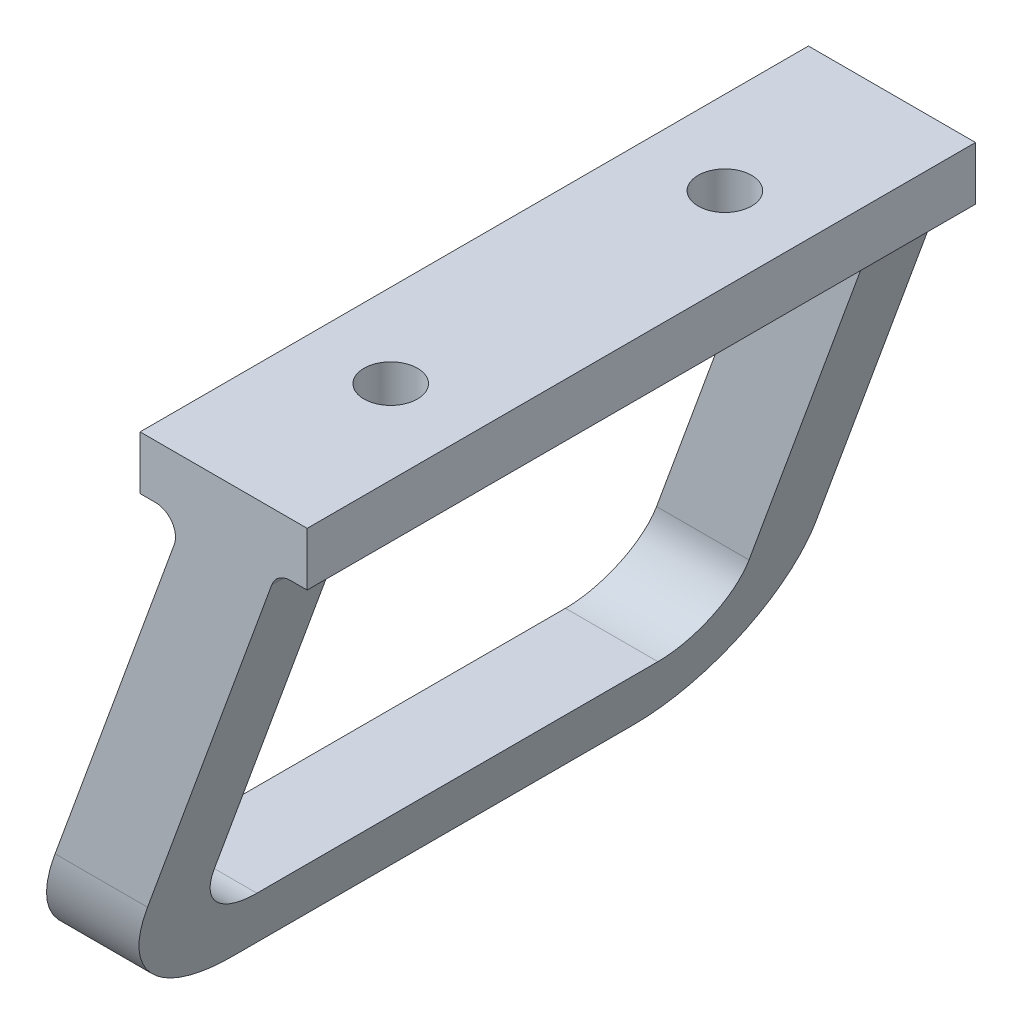
ISO-10303-21;
HEADER;
FILE_DESCRIPTION(('STEP AP214'),'2;1');
FILE_NAME('part.step','',(''),(''),'','','');
FILE_SCHEMA(('AUTOMOTIVE_DESIGN { 1 0 10303 214 1 1 1 1 }'));
ENDSEC;
DATA;
#1=APPLICATION_CONTEXT('core data for automotive mechanical design processes');
#2=APPLICATION_PROTOCOL_DEFINITION('international standard','automotive_design',2000,#1);
#3=PRODUCT_CONTEXT('',#1,'mechanical');
#4=PRODUCT('Part','Part','',(#3));
#5=PRODUCT_RELATED_PRODUCT_CATEGORY('part','',(#4));
#6=PRODUCT_DEFINITION_FORMATION('','',#4);
#7=PRODUCT_DEFINITION_CONTEXT('part definition',#1,'design');
#8=PRODUCT_DEFINITION('design','',#6,#7);
#9=PRODUCT_DEFINITION_SHAPE('','',#8);
#10=(LENGTH_UNIT() NAMED_UNIT(*) SI_UNIT(.MILLI.,.METRE.));
#11=(NAMED_UNIT(*) PLANE_ANGLE_UNIT() SI_UNIT($,.RADIAN.));
#12=(NAMED_UNIT(*) SI_UNIT($,.STERADIAN.) SOLID_ANGLE_UNIT());
#13=UNCERTAINTY_MEASURE_WITH_UNIT(LENGTH_MEASURE(1.E-05),#10,'distance_accuracy_value','');
#14=(GEOMETRIC_REPRESENTATION_CONTEXT(3) GLOBAL_UNCERTAINTY_ASSIGNED_CONTEXT((#13)) GLOBAL_UNIT_ASSIGNED_CONTEXT((#10,
#11,#12)) REPRESENTATION_CONTEXT('',''));
#15=CARTESIAN_POINT('',(0.,0.,0.));
#16=DIRECTION('',(0.,0.,1.));
#17=DIRECTION('',(1.,0.,0.));
#18=AXIS2_PLACEMENT_3D('',#15,#16,#17);
#19=CARTESIAN_POINT('',(-3.93799216364615,1.43331193034076,100.));
#20=DIRECTION('',(-0.939692620785908,0.342020143325669,0.));
#21=DIRECTION('',(-0.342020143325669,-0.939692620785908,0.));
#22=AXIS2_PLACEMENT_3D('',#19,#20,#21);
#23=PLANE('',#22);
#24=DIRECTION('',(0.,0.,1.));
#25=VECTOR('',#24,1.);
#26=CARTESIAN_POINT('',(-28.860297657338,-67.0401596543272,100.));
#27=LINE('',#26,#25);
#28=CARTESIAN_POINT('',(-28.860297657338,-67.0401596543272,20.0000000000001));
#29=VERTEX_POINT('',#28);
#30=CARTESIAN_POINT('',(-28.860297657338,-67.0401596543272,79.9999999999999));
#31=VERTEX_POINT('',#30);
#32=EDGE_CURVE('E289',#29,#31,#27,.T.);
#33=ORIENTED_EDGE('',*,*,#32,.F.);
#34=CARTESIAN_POINT('',(-25.2205953146759,-57.0401596543272,20.));
#35=DIRECTION('',(-0.939692620785908,0.342020143325669,0.));
#36=DIRECTION('',(-0.342020143325669,-0.939692620785908,0.));
#37=AXIS2_PLACEMENT_3D('',#34,#35,#36);
#38=ELLIPSE('',#37,10.6417777247591,10.);
#39=CARTESIAN_POINT('',(-25.2205953146759,-57.0401596543272,9.99999999999999));
#40=VERTEX_POINT('',#39);
#41=EDGE_CURVE('E402',#29,#40,#38,.F.);
#42=ORIENTED_EDGE('',*,*,#41,.T.);
#43=DIRECTION('',(0.342020143325669,0.939692620785908,0.));
#44=VECTOR('',#43,1.);
#45=CARTESIAN_POINT('',(-3.93799216364615,1.43331193034076,9.99999999999999));
#46=LINE('',#45,#44);
#47=CARTESIAN_POINT('',(-8.46334761963706,-11.,9.99999999999999));
#48=VERTEX_POINT('',#47);
#49=EDGE_CURVE('E398',#40,#48,#46,.T.);
#50=ORIENTED_EDGE('',*,*,#49,.T.);
#51=DIRECTION('',(0.,0.,1.));
#52=VECTOR('',#51,1.);
#53=CARTESIAN_POINT('',(-8.46334761963705,-11.,100.));
#54=LINE('',#53,#52);
#55=CARTESIAN_POINT('',(-8.46334761963705,-11.,90.));
#56=VERTEX_POINT('',#55);
#57=EDGE_CURVE('E394',#48,#56,#54,.T.);
#58=ORIENTED_EDGE('',*,*,#57,.T.);
#59=DIRECTION('',(0.342020143325669,0.939692620785908,0.));
#60=VECTOR('',#59,1.);
#61=CARTESIAN_POINT('',(-3.93799216364615,1.43331193034076,90.));
#62=LINE('',#61,#60);
#63=CARTESIAN_POINT('',(-25.2205953146759,-57.0401596543272,90.));
#64=VERTEX_POINT('',#63);
#65=EDGE_CURVE('E391',#64,#56,#62,.T.);
#66=ORIENTED_EDGE('',*,*,#65,.F.);
#67=CARTESIAN_POINT('',(-25.2205953146759,-57.0401596543272,80.));
#68=DIRECTION('',(-0.939692620785908,0.342020143325669,0.));
#69=DIRECTION('',(-0.342020143325669,-0.939692620785908,0.));
#70=AXIS2_PLACEMENT_3D('',#67,#68,#69);
#71=ELLIPSE('',#70,10.6417777247591,9.99999999999999);
#72=EDGE_CURVE('E388',#31,#64,#71,.T.);
#73=ORIENTED_EDGE('',*,*,#72,.F.);
#74=EDGE_LOOP('',(#33,#42,#50,#58,#66,#73));
#75=FACE_BOUND('',#74,.T.);
#76=DIRECTION('',(0.342020143325669,0.939692620785908,0.));
#77=VECTOR('',#76,1.);
#78=CARTESIAN_POINT('',(-3.93799216364615,1.43331193034076,0.));
#79=LINE('',#78,#77);
#80=CARTESIAN_POINT('',(-25.2205953146759,-57.0401596543272,0.));
#81=VERTEX_POINT('',#80);
#82=CARTESIAN_POINT('',(-7.38092213764225,-8.02606042997701,0.));
#83=VERTEX_POINT('',#82);
#84=EDGE_CURVE('E444',#81,#83,#79,.T.);
#85=ORIENTED_EDGE('',*,*,#84,.F.);
#86=CARTESIAN_POINT('',(-25.2205953146759,-57.0401596543272,20.));
#87=DIRECTION('',(-0.939692620785908,0.342020143325669,0.));
#88=DIRECTION('',(-0.342020143325669,-0.939692620785908,0.));
#89=AXIS2_PLACEMENT_3D('',#86,#87,#88);
#90=ELLIPSE('',#89,21.2835554495182,20.);
#91=CARTESIAN_POINT('',(-32.5,-77.0401596543272,20.));
#92=VERTEX_POINT('',#91);
#93=EDGE_CURVE('E305',#81,#92,#90,.T.);
#94=ORIENTED_EDGE('',*,*,#93,.T.);
#95=DIRECTION('',(0.,0.,-1.));
#96=VECTOR('',#95,1.);
#97=CARTESIAN_POINT('',(-32.5,-77.0401596543272,100.));
#98=LINE('',#97,#96);
#99=CARTESIAN_POINT('',(-32.5,-77.0401596543272,80.));
#100=VERTEX_POINT('',#99);
#101=EDGE_CURVE('E297',#100,#92,#98,.T.);
#102=ORIENTED_EDGE('',*,*,#101,.F.);
#103=CARTESIAN_POINT('',(-25.2205953146759,-57.0401596543272,80.));
#104=DIRECTION('',(-0.939692620785908,0.342020143325669,0.));
#105=DIRECTION('',(-0.342020143325669,-0.939692620785908,0.));
#106=AXIS2_PLACEMENT_3D('',#103,#104,#105);
#107=ELLIPSE('',#106,21.2835554495182,20.);
#108=CARTESIAN_POINT('',(-25.2205953146759,-57.0401596543272,100.));
#109=VERTEX_POINT('',#108);
#110=EDGE_CURVE('E278',#100,#109,#107,.T.);
#111=ORIENTED_EDGE('',*,*,#110,.T.);
#112=DIRECTION('',(0.342020143325669,0.939692620785908,0.));
#113=VECTOR('',#112,1.);
#114=CARTESIAN_POINT('',(-3.93799216364615,1.43331193034076,100.));
#115=LINE('',#114,#113);
#116=CARTESIAN_POINT('',(-7.38092213764225,-8.02606042997701,100.));
#117=VERTEX_POINT('',#116);
#118=EDGE_CURVE('E411',#109,#117,#115,.T.);
#119=ORIENTED_EDGE('',*,*,#118,.T.);
#120=DIRECTION('',(0.,0.,-1.));
#121=VECTOR('',#120,1.);
#122=CARTESIAN_POINT('',(-7.38092213764225,-8.02606042997701,100.));
#123=LINE('',#122,#121);
#124=EDGE_CURVE('E307',#117,#83,#123,.T.);
#125=ORIENTED_EDGE('',*,*,#124,.T.);
#126=EDGE_LOOP('',(#85,#94,#102,#111,#119,#125));
#127=FACE_BOUND('',#126,.T.);
#128=ADVANCED_FACE('F152',(#75,#127),#23,.T.);
#129=CARTESIAN_POINT('',(0.,-77.0401596543272,100.));
#130=DIRECTION('',(0.,-1.,0.));
#131=DIRECTION('',(0.,0.,-1.));
#132=AXIS2_PLACEMENT_3D('',#129,#130,#131);
#133=PLANE('',#132);
#134=DIRECTION('',(-1.,0.,0.));
#135=VECTOR('',#134,1.);
#136=CARTESIAN_POINT('',(12.5,-77.0401596543272,20.));
#137=LINE('',#136,#135);
#138=CARTESIAN_POINT('',(-18.6656889578131,-77.0401596543272,20.));
#139=VERTEX_POINT('',#138);
#140=EDGE_CURVE('E301',#139,#92,#137,.T.);
#141=ORIENTED_EDGE('',*,*,#140,.F.);
#142=DIRECTION('',(0.,0.,-1.));
#143=VECTOR('',#142,1.);
#144=CARTESIAN_POINT('',(-18.6656889578131,-77.0401596543272,100.));
#145=LINE('',#144,#143);
#146=CARTESIAN_POINT('',(-18.6656889578131,-77.0401596543272,80.));
#147=VERTEX_POINT('',#146);
#148=EDGE_CURVE('E299',#147,#139,#145,.T.);
#149=ORIENTED_EDGE('',*,*,#148,.F.);
#150=DIRECTION('',(-1.,0.,0.));
#151=VECTOR('',#150,1.);
#152=CARTESIAN_POINT('',(12.5,-77.0401596543272,80.));
#153=LINE('',#152,#151);
#154=EDGE_CURVE('E281',#147,#100,#153,.T.);
#155=ORIENTED_EDGE('',*,*,#154,.T.);
#156=ORIENTED_EDGE('',*,*,#101,.T.);
#157=EDGE_LOOP('',(#141,#149,#155,#156));
#158=FACE_BOUND('',#157,.T.);
#159=ADVANCED_FACE('F296',(#158),#133,.T.);
#160=CARTESIAN_POINT('',(8.27801190657065,-3.01294993289294,100.));
#161=DIRECTION('',(0.939692620785908,-0.342020143325669,0.));
#162=DIRECTION('',(0.342020143325669,0.939692620785908,0.));
#163=AXIS2_PLACEMENT_3D('',#160,#161,#162);
#164=PLANE('',#163);
#165=DIRECTION('',(-0.342020143325669,-0.939692620785908,0.));
#166=VECTOR('',#165,1.);
#167=CARTESIAN_POINT('',(8.27801190657065,-3.01294993289294,9.99999999999999));
#168=LINE('',#167,#166);
#169=CARTESIAN_POINT('',(5.3709634225498,-11.,9.99999999999999));
#170=VERTEX_POINT('',#169);
#171=CARTESIAN_POINT('',(-11.3862842724891,-57.0401596543272,9.99999999999999));
#172=VERTEX_POINT('',#171);
#173=EDGE_CURVE('E162',#170,#172,#168,.T.);
#174=ORIENTED_EDGE('',*,*,#173,.T.);
#175=CARTESIAN_POINT('',(-11.3862842724891,-57.0401596543272,20.));
#176=DIRECTION('',(0.939692620785908,-0.342020143325669,0.));
#177=DIRECTION('',(-0.342020143325669,-0.939692620785908,0.));
#178=AXIS2_PLACEMENT_3D('',#175,#176,#177);
#179=ELLIPSE('',#178,10.6417777247591,10.);
#180=CARTESIAN_POINT('',(-15.0259866151511,-67.0401596543272,20.0000000000001));
#181=VERTEX_POINT('',#180);
#182=EDGE_CURVE('E12',#172,#181,#179,.F.);
#183=ORIENTED_EDGE('',*,*,#182,.T.);
#184=DIRECTION('',(0.,0.,-1.));
#185=VECTOR('',#184,1.);
#186=CARTESIAN_POINT('',(-15.0259866151511,-67.0401596543272,100.));
#187=LINE('',#186,#185);
#188=CARTESIAN_POINT('',(-15.0259866151511,-67.0401596543272,79.9999999999999));
#189=VERTEX_POINT('',#188);
#190=EDGE_CURVE('E323',#189,#181,#187,.T.);
#191=ORIENTED_EDGE('',*,*,#190,.F.);
#192=CARTESIAN_POINT('',(-11.3862842724891,-57.0401596543272,80.));
#193=DIRECTION('',(0.939692620785908,-0.342020143325669,0.));
#194=DIRECTION('',(-0.342020143325669,-0.939692620785908,0.));
#195=AXIS2_PLACEMENT_3D('',#192,#193,#194);
#196=ELLIPSE('',#195,10.6417777247591,9.99999999999999);
#197=CARTESIAN_POINT('',(-11.386284272489,-57.0401596543272,90.));
#198=VERTEX_POINT('',#197);
#199=EDGE_CURVE('E326',#198,#189,#196,.T.);
#200=ORIENTED_EDGE('',*,*,#199,.F.);
#201=DIRECTION('',(-0.342020143325669,-0.939692620785908,0.));
#202=VECTOR('',#201,1.);
#203=CARTESIAN_POINT('',(8.27801190657065,-3.01294993289294,90.));
#204=LINE('',#203,#202);
#205=CARTESIAN_POINT('',(5.3709634225498,-11.,90.));
#206=VERTEX_POINT('',#205);
#207=EDGE_CURVE('E329',#206,#198,#204,.T.);
#208=ORIENTED_EDGE('',*,*,#207,.F.);
#209=DIRECTION('',(0.,0.,-1.));
#210=VECTOR('',#209,1.);
#211=CARTESIAN_POINT('',(5.3709634225498,-11.,100.));
#212=LINE('',#211,#210);
#213=EDGE_CURVE('E332',#206,#170,#212,.T.);
#214=ORIENTED_EDGE('',*,*,#213,.T.);
#215=EDGE_LOOP('',(#174,#183,#191,#200,#208,#214));
#216=FACE_BOUND('',#215,.T.);
#217=ORIENTED_EDGE('',*,*,#148,.T.);
#218=CARTESIAN_POINT('',(-11.3862842724891,-57.0401596543272,20.));
#219=DIRECTION('',(0.939692620785908,-0.342020143325669,0.));
#220=DIRECTION('',(-0.342020143325669,-0.939692620785908,0.));
#221=AXIS2_PLACEMENT_3D('',#218,#219,#220);
#222=ELLIPSE('',#221,21.2835554495182,20.);
#223=CARTESIAN_POINT('',(-11.3862842724891,-57.0401596543271,0.));
#224=VERTEX_POINT('',#223);
#225=EDGE_CURVE('E362',#139,#224,#222,.T.);
#226=ORIENTED_EDGE('',*,*,#225,.T.);
#227=DIRECTION('',(-0.342020143325669,-0.939692620785908,0.));
#228=VECTOR('',#227,1.);
#229=CARTESIAN_POINT('',(8.27801190657065,-3.01294993289294,0.));
#230=LINE('',#229,#228);
#231=CARTESIAN_POINT('',(7.20029981468462,-5.97393957002299,0.));
#232=VERTEX_POINT('',#231);
#233=EDGE_CURVE('E447',#232,#224,#230,.T.);
#234=ORIENTED_EDGE('',*,*,#233,.F.);
#235=DIRECTION('',(0.,0.,-1.));
#236=VECTOR('',#235,1.);
#237=CARTESIAN_POINT('',(7.20029981468462,-5.97393957002299,100.));
#238=LINE('',#237,#236);
#239=CARTESIAN_POINT('',(7.20029981468462,-5.97393957002299,100.));
#240=VERTEX_POINT('',#239);
#241=EDGE_CURVE('E314',#240,#232,#238,.T.);
#242=ORIENTED_EDGE('',*,*,#241,.F.);
#243=DIRECTION('',(-0.342020143325669,-0.939692620785908,0.));
#244=VECTOR('',#243,1.);
#245=CARTESIAN_POINT('',(8.27801190657065,-3.01294993289294,100.));
#246=LINE('',#245,#244);
#247=CARTESIAN_POINT('',(-11.3862842724891,-57.0401596543272,100.));
#248=VERTEX_POINT('',#247);
#249=EDGE_CURVE('E415',#240,#248,#246,.T.);
#250=ORIENTED_EDGE('',*,*,#249,.T.);
#251=CARTESIAN_POINT('',(-11.3862842724891,-57.0401596543272,80.));
#252=DIRECTION('',(0.939692620785908,-0.342020143325669,0.));
#253=DIRECTION('',(-0.342020143325669,-0.939692620785908,0.));
#254=AXIS2_PLACEMENT_3D('',#251,#252,#253);
#255=ELLIPSE('',#254,21.2835554495182,20.);
#256=EDGE_CURVE('E290',#248,#147,#255,.T.);
#257=ORIENTED_EDGE('',*,*,#256,.T.);
#258=EDGE_LOOP('',(#217,#226,#234,#242,#250,#257));
#259=FACE_BOUND('',#258,.T.);
#260=ADVANCED_FACE('F498',(#216,#259),#164,.T.);
#261=CARTESIAN_POINT('',(-10.2,-7.,100.));
#262=DIRECTION('',(0.,0.,-1.));
#263=DIRECTION('',(-1.,0.,0.));
#264=AXIS2_PLACEMENT_3D('',#261,#262,#263);
#265=CYLINDRICAL_SURFACE('',#264,3.00000000000001);
#266=CARTESIAN_POINT('',(-10.2,-7.,0.));
#267=DIRECTION('',(0.,0.,1.));
#268=DIRECTION('',(1.,0.,0.));
#269=AXIS2_PLACEMENT_3D('',#266,#267,#268);
#270=CIRCLE('',#269,3.00000000000001);
#271=CARTESIAN_POINT('',(-10.2,-4.,0.));
#272=VERTEX_POINT('',#271);
#273=EDGE_CURVE('E406',#83,#272,#270,.T.);
#274=ORIENTED_EDGE('',*,*,#273,.F.);
#275=ORIENTED_EDGE('',*,*,#124,.F.);
#276=CARTESIAN_POINT('',(-10.2,-7.,100.));
#277=DIRECTION('',(0.,0.,1.));
#278=DIRECTION('',(1.,0.,0.));
#279=AXIS2_PLACEMENT_3D('',#276,#277,#278);
#280=CIRCLE('',#279,3.00000000000001);
#281=CARTESIAN_POINT('',(-10.2,-4.,100.));
#282=VERTEX_POINT('',#281);
#283=EDGE_CURVE('E407',#117,#282,#280,.T.);
#284=ORIENTED_EDGE('',*,*,#283,.T.);
#285=DIRECTION('',(0.,0.,-1.));
#286=VECTOR('',#285,1.);
#287=CARTESIAN_POINT('',(-10.2,-4.,100.));
#288=LINE('',#287,#286);
#289=EDGE_CURVE('E440',#282,#272,#288,.T.);
#290=ORIENTED_EDGE('',*,*,#289,.T.);
#291=EDGE_LOOP('',(#274,#275,#284,#290));
#292=FACE_BOUND('',#291,.T.);
#293=ADVANCED_FACE('F154',(#292),#265,.F.);
#294=CARTESIAN_POINT('',(10.0193776770423,-7.,100.));
#295=DIRECTION('',(0.,0.,-1.));
#296=DIRECTION('',(-1.,0.,0.));
#297=AXIS2_PLACEMENT_3D('',#294,#295,#296);
#298=CYLINDRICAL_SURFACE('',#297,3.);
#299=CARTESIAN_POINT('',(10.0193776770423,-7.,0.));
#300=DIRECTION('',(0.,0.,1.));
#301=DIRECTION('',(1.,0.,0.));
#302=AXIS2_PLACEMENT_3D('',#299,#300,#301);
#303=CIRCLE('',#302,3.);
#304=CARTESIAN_POINT('',(10.0193776770423,-4.,0.));
#305=VERTEX_POINT('',#304);
#306=EDGE_CURVE('E451',#305,#232,#303,.T.);
#307=ORIENTED_EDGE('',*,*,#306,.F.);
#308=DIRECTION('',(0.,0.,-1.));
#309=VECTOR('',#308,1.);
#310=CARTESIAN_POINT('',(10.0193776770423,-4.,100.));
#311=LINE('',#310,#309);
#312=CARTESIAN_POINT('',(10.0193776770423,-4.,100.));
#313=VERTEX_POINT('',#312);
#314=EDGE_CURVE('E488',#313,#305,#311,.T.);
#315=ORIENTED_EDGE('',*,*,#314,.F.);
#316=CARTESIAN_POINT('',(10.0193776770423,-7.,100.));
#317=DIRECTION('',(0.,0.,1.));
#318=DIRECTION('',(1.,0.,0.));
#319=AXIS2_PLACEMENT_3D('',#316,#317,#318);
#320=CIRCLE('',#319,3.);
#321=EDGE_CURVE('E419',#313,#240,#320,.T.);
#322=ORIENTED_EDGE('',*,*,#321,.T.);
#323=ORIENTED_EDGE('',*,*,#241,.T.);
#324=EDGE_LOOP('',(#307,#315,#322,#323));
#325=FACE_BOUND('',#324,.T.);
#326=ADVANCED_FACE('F494',(#325),#298,.F.);
#327=CARTESIAN_POINT('',(0.,-4.,100.));
#328=DIRECTION('',(0.,1.,0.));
#329=DIRECTION('',(-1.,0.,0.));
#330=AXIS2_PLACEMENT_3D('',#327,#328,#329);
#331=PLANE('',#330);
#332=DIRECTION('',(1.,0.,0.));
#333=VECTOR('',#332,1.);
#334=CARTESIAN_POINT('',(0.,-4.,0.));
#335=LINE('',#334,#333);
#336=CARTESIAN_POINT('',(12.5,-4.,0.));
#337=VERTEX_POINT('',#336);
#338=EDGE_CURVE('E455',#305,#337,#335,.T.);
#339=ORIENTED_EDGE('',*,*,#338,.T.);
#340=DIRECTION('',(0.,0.,-1.));
#341=VECTOR('',#340,1.);
#342=CARTESIAN_POINT('',(12.5,-4.,100.));
#343=LINE('',#342,#341);
#344=CARTESIAN_POINT('',(12.5,-4.,100.));
#345=VERTEX_POINT('',#344);
#346=EDGE_CURVE('E485',#345,#337,#343,.T.);
#347=ORIENTED_EDGE('',*,*,#346,.F.);
#348=DIRECTION('',(1.,0.,0.));
#349=VECTOR('',#348,1.);
#350=CARTESIAN_POINT('',(0.,-4.,100.));
#351=LINE('',#350,#349);
#352=EDGE_CURVE('E423',#313,#345,#351,.T.);
#353=ORIENTED_EDGE('',*,*,#352,.F.);
#354=ORIENTED_EDGE('',*,*,#314,.T.);
#355=EDGE_LOOP('',(#339,#347,#353,#354));
#356=FACE_BOUND('',#355,.T.);
#357=ADVANCED_FACE('F505',(#356),#331,.F.);
#358=CARTESIAN_POINT('',(12.5,0.,100.));
#359=DIRECTION('',(1.,0.,0.));
#360=DIRECTION('',(0.,1.,0.));
#361=AXIS2_PLACEMENT_3D('',#358,#359,#360);
#362=PLANE('',#361);
#363=DIRECTION('',(0.,-1.,0.));
#364=VECTOR('',#363,1.);
#365=CARTESIAN_POINT('',(12.5,0.,0.));
#366=LINE('',#365,#364);
#367=CARTESIAN_POINT('',(12.5,4.,0.));
#368=VERTEX_POINT('',#367);
#369=EDGE_CURVE('E459',#368,#337,#366,.T.);
#370=ORIENTED_EDGE('',*,*,#369,.F.);
#371=DIRECTION('',(0.,0.,-1.));
#372=VECTOR('',#371,1.);
#373=CARTESIAN_POINT('',(12.5,4.,100.));
#374=LINE('',#373,#372);
#375=CARTESIAN_POINT('',(12.5,4.,100.));
#376=VERTEX_POINT('',#375);
#377=EDGE_CURVE('E482',#376,#368,#374,.T.);
#378=ORIENTED_EDGE('',*,*,#377,.F.);
#379=DIRECTION('',(0.,-1.,0.));
#380=VECTOR('',#379,1.);
#381=CARTESIAN_POINT('',(12.5,0.,100.));
#382=LINE('',#381,#380);
#383=EDGE_CURVE('E426',#376,#345,#382,.T.);
#384=ORIENTED_EDGE('',*,*,#383,.T.);
#385=ORIENTED_EDGE('',*,*,#346,.T.);
#386=EDGE_LOOP('',(#370,#378,#384,#385));
#387=FACE_BOUND('',#386,.T.);
#388=ADVANCED_FACE('F544',(#387),#362,.T.);
#389=CARTESIAN_POINT('',(0.,4.,100.));
#390=DIRECTION('',(0.,1.,0.));
#391=DIRECTION('',(0.,0.,1.));
#392=AXIS2_PLACEMENT_3D('',#389,#390,#391);
#393=PLANE('',#392);
#394=CARTESIAN_POINT('',(0.,4.,25.));
#395=DIRECTION('',(0.,1.,0.));
#396=DIRECTION('',(0.,0.,1.));
#397=AXIS2_PLACEMENT_3D('',#394,#395,#396);
#398=CIRCLE('',#397,4.);
#399=CARTESIAN_POINT('',(0.,4.,29.));
#400=VERTEX_POINT('',#399);
#401=EDGE_CURVE('E351',#400,#400,#398,.T.);
#402=ORIENTED_EDGE('',*,*,#401,.F.);
#403=EDGE_LOOP('',(#402));
#404=FACE_BOUND('',#403,.T.);
#405=CARTESIAN_POINT('',(0.,4.,75.));
#406=DIRECTION('',(0.,1.,0.));
#407=DIRECTION('',(0.,0.,1.));
#408=AXIS2_PLACEMENT_3D('',#405,#406,#407);
#409=CIRCLE('',#408,4.);
#410=CARTESIAN_POINT('',(0.,4.,79.));
#411=VERTEX_POINT('',#410);
#412=EDGE_CURVE('E341',#411,#411,#409,.T.);
#413=ORIENTED_EDGE('',*,*,#412,.F.);
#414=EDGE_LOOP('',(#413));
#415=FACE_BOUND('',#414,.T.);
#416=DIRECTION('',(1.,0.,0.));
#417=VECTOR('',#416,1.);
#418=CARTESIAN_POINT('',(0.,4.,0.));
#419=LINE('',#418,#417);
#420=CARTESIAN_POINT('',(-12.5,4.,0.));
#421=VERTEX_POINT('',#420);
#422=EDGE_CURVE('E463',#421,#368,#419,.T.);
#423=ORIENTED_EDGE('',*,*,#422,.F.);
#424=DIRECTION('',(0.,0.,-1.));
#425=VECTOR('',#424,1.);
#426=CARTESIAN_POINT('',(-12.5,4.,100.));
#427=LINE('',#426,#425);
#428=CARTESIAN_POINT('',(-12.5,4.,100.));
#429=VERTEX_POINT('',#428);
#430=EDGE_CURVE('E479',#429,#421,#427,.T.);
#431=ORIENTED_EDGE('',*,*,#430,.F.);
#432=DIRECTION('',(1.,0.,0.));
#433=VECTOR('',#432,1.);
#434=CARTESIAN_POINT('',(0.,4.,100.));
#435=LINE('',#434,#433);
#436=EDGE_CURVE('E430',#429,#376,#435,.T.);
#437=ORIENTED_EDGE('',*,*,#436,.T.);
#438=ORIENTED_EDGE('',*,*,#377,.T.);
#439=EDGE_LOOP('',(#423,#431,#437,#438));
#440=FACE_BOUND('',#439,.T.);
#441=ADVANCED_FACE('F547',(#404,#415,#440),#393,.T.);
#442=CARTESIAN_POINT('',(-12.5,0.,100.));
#443=DIRECTION('',(1.,0.,0.));
#444=DIRECTION('',(0.,1.,0.));
#445=AXIS2_PLACEMENT_3D('',#442,#443,#444);
#446=PLANE('',#445);
#447=DIRECTION('',(0.,-1.,0.));
#448=VECTOR('',#447,1.);
#449=CARTESIAN_POINT('',(-12.5,0.,0.));
#450=LINE('',#449,#448);
#451=CARTESIAN_POINT('',(-12.5,-4.,0.));
#452=VERTEX_POINT('',#451);
#453=EDGE_CURVE('E467',#421,#452,#450,.T.);
#454=ORIENTED_EDGE('',*,*,#453,.T.);
#455=DIRECTION('',(0.,0.,-1.));
#456=VECTOR('',#455,1.);
#457=CARTESIAN_POINT('',(-12.5,-4.,100.));
#458=LINE('',#457,#456);
#459=CARTESIAN_POINT('',(-12.5,-4.,100.));
#460=VERTEX_POINT('',#459);
#461=EDGE_CURVE('E475',#460,#452,#458,.T.);
#462=ORIENTED_EDGE('',*,*,#461,.F.);
#463=DIRECTION('',(0.,-1.,0.));
#464=VECTOR('',#463,1.);
#465=CARTESIAN_POINT('',(-12.5,0.,100.));
#466=LINE('',#465,#464);
#467=EDGE_CURVE('E434',#429,#460,#466,.T.);
#468=ORIENTED_EDGE('',*,*,#467,.F.);
#469=ORIENTED_EDGE('',*,*,#430,.T.);
#470=EDGE_LOOP('',(#454,#462,#468,#469));
#471=FACE_BOUND('',#470,.T.);
#472=ADVANCED_FACE('F551',(#471),#446,.F.);
#473=CARTESIAN_POINT('',(0.,-3.99999999999999,100.));
#474=DIRECTION('',(0.,1.,0.));
#475=DIRECTION('',(-1.,0.,0.));
#476=AXIS2_PLACEMENT_3D('',#473,#474,#475);
#477=PLANE('',#476);
#478=DIRECTION('',(1.,0.,0.));
#479=VECTOR('',#478,1.);
#480=CARTESIAN_POINT('',(0.,-3.99999999999999,0.));
#481=LINE('',#480,#479);
#482=EDGE_CURVE('E412',#452,#272,#481,.T.);
#483=ORIENTED_EDGE('',*,*,#482,.T.);
#484=ORIENTED_EDGE('',*,*,#289,.F.);
#485=DIRECTION('',(1.,0.,0.));
#486=VECTOR('',#485,1.);
#487=CARTESIAN_POINT('',(0.,-3.99999999999999,100.));
#488=LINE('',#487,#486);
#489=EDGE_CURVE('E437',#460,#282,#488,.T.);
#490=ORIENTED_EDGE('',*,*,#489,.F.);
#491=ORIENTED_EDGE('',*,*,#461,.T.);
#492=EDGE_LOOP('',(#483,#484,#490,#491));
#493=FACE_BOUND('',#492,.T.);
#494=ADVANCED_FACE('F555',(#493),#477,.F.);
#495=CARTESIAN_POINT('',(0.,0.,100.));
#496=DIRECTION('',(0.,0.,1.));
#497=DIRECTION('',(1.,0.,0.));
#498=AXIS2_PLACEMENT_3D('',#495,#496,#497);
#499=PLANE('',#498);
#500=DIRECTION('',(-1.,0.,0.));
#501=VECTOR('',#500,1.);
#502=CARTESIAN_POINT('',(12.5,-57.0401596543272,100.));
#503=LINE('',#502,#501);
#504=EDGE_CURVE('E284',#248,#109,#503,.T.);
#505=ORIENTED_EDGE('',*,*,#504,.F.);
#506=ORIENTED_EDGE('',*,*,#249,.F.);
#507=ORIENTED_EDGE('',*,*,#321,.F.);
#508=ORIENTED_EDGE('',*,*,#352,.T.);
#509=ORIENTED_EDGE('',*,*,#383,.F.);
#510=ORIENTED_EDGE('',*,*,#436,.F.);
#511=ORIENTED_EDGE('',*,*,#467,.T.);
#512=ORIENTED_EDGE('',*,*,#489,.T.);
#513=ORIENTED_EDGE('',*,*,#283,.F.);
#514=ORIENTED_EDGE('',*,*,#118,.F.);
#515=EDGE_LOOP('',(#505,#506,#507,#508,#509,#510,#511,#512,#513,#514));
#516=FACE_BOUND('',#515,.T.);
#517=ADVANCED_FACE('F509',(#516),#499,.T.);
#518=CARTESIAN_POINT('',(0.,0.,0.));
#519=DIRECTION('',(0.,0.,1.));
#520=DIRECTION('',(1.,0.,0.));
#521=AXIS2_PLACEMENT_3D('',#518,#519,#520);
#522=PLANE('',#521);
#523=ORIENTED_EDGE('',*,*,#233,.T.);
#524=DIRECTION('',(-1.,0.,0.));
#525=VECTOR('',#524,1.);
#526=CARTESIAN_POINT('',(12.5,-57.0401596543272,0.));
#527=LINE('',#526,#525);
#528=EDGE_CURVE('E312',#224,#81,#527,.T.);
#529=ORIENTED_EDGE('',*,*,#528,.T.);
#530=ORIENTED_EDGE('',*,*,#84,.T.);
#531=ORIENTED_EDGE('',*,*,#273,.T.);
#532=ORIENTED_EDGE('',*,*,#482,.F.);
#533=ORIENTED_EDGE('',*,*,#453,.F.);
#534=ORIENTED_EDGE('',*,*,#422,.T.);
#535=ORIENTED_EDGE('',*,*,#369,.T.);
#536=ORIENTED_EDGE('',*,*,#338,.F.);
#537=ORIENTED_EDGE('',*,*,#306,.T.);
#538=EDGE_LOOP('',(#523,#529,#530,#531,#532,#533,#534,#535,#536,#537));
#539=FACE_BOUND('',#538,.T.);
#540=ADVANCED_FACE('F501',(#539),#522,.F.);
#541=CARTESIAN_POINT('',(12.5,-57.0401596543272,20.));
#542=DIRECTION('',(-1.,0.,0.));
#543=DIRECTION('',(0.,-1.,0.));
#544=AXIS2_PLACEMENT_3D('',#541,#542,#543);
#545=CYLINDRICAL_SURFACE('',#544,20.);
#546=ORIENTED_EDGE('',*,*,#528,.F.);
#547=ORIENTED_EDGE('',*,*,#225,.F.);
#548=ORIENTED_EDGE('',*,*,#140,.T.);
#549=ORIENTED_EDGE('',*,*,#93,.F.);
#550=EDGE_LOOP('',(#546,#547,#548,#549));
#551=FACE_BOUND('',#550,.T.);
#552=ADVANCED_FACE('F518',(#551),#545,.T.);
#553=CARTESIAN_POINT('',(12.5,-57.0401596543272,80.));
#554=DIRECTION('',(-1.,0.,0.));
#555=DIRECTION('',(0.,-1.,0.));
#556=AXIS2_PLACEMENT_3D('',#553,#554,#555);
#557=CYLINDRICAL_SURFACE('',#556,20.);
#558=ORIENTED_EDGE('',*,*,#154,.F.);
#559=ORIENTED_EDGE('',*,*,#256,.F.);
#560=ORIENTED_EDGE('',*,*,#504,.T.);
#561=ORIENTED_EDGE('',*,*,#110,.F.);
#562=EDGE_LOOP('',(#558,#559,#560,#561));
#563=FACE_BOUND('',#562,.T.);
#564=ADVANCED_FACE('F280',(#563),#557,.T.);
#565=CARTESIAN_POINT('',(12.5,-57.0401596543272,20.));
#566=DIRECTION('',(-1.,0.,0.));
#567=DIRECTION('',(0.,-1.,0.));
#568=AXIS2_PLACEMENT_3D('',#565,#566,#567);
#569=CYLINDRICAL_SURFACE('',#568,10.);
#570=DIRECTION('',(-1.,0.,0.));
#571=VECTOR('',#570,1.);
#572=CARTESIAN_POINT('',(12.5,-67.0401596543272,20.0000000000001));
#573=LINE('',#572,#571);
#574=EDGE_CURVE('E170',#181,#29,#573,.T.);
#575=ORIENTED_EDGE('',*,*,#574,.F.);
#576=ORIENTED_EDGE('',*,*,#182,.F.);
#577=DIRECTION('',(-1.,0.,0.));
#578=VECTOR('',#577,1.);
#579=CARTESIAN_POINT('',(12.5,-57.0401596543272,9.99999999999999));
#580=LINE('',#579,#578);
#581=EDGE_CURVE('E358',#172,#40,#580,.T.);
#582=ORIENTED_EDGE('',*,*,#581,.T.);
#583=ORIENTED_EDGE('',*,*,#41,.F.);
#584=EDGE_LOOP('',(#575,#576,#582,#583));
#585=FACE_BOUND('',#584,.T.);
#586=ADVANCED_FACE('F525',(#585),#569,.F.);
#587=CARTESIAN_POINT('',(12.5,0.,9.99999999999999));
#588=DIRECTION('',(0.,0.,1.));
#589=DIRECTION('',(1.,0.,0.));
#590=AXIS2_PLACEMENT_3D('',#587,#588,#589);
#591=PLANE('',#590);
#592=ORIENTED_EDGE('',*,*,#581,.F.);
#593=ORIENTED_EDGE('',*,*,#173,.F.);
#594=DIRECTION('',(-1.,0.,0.));
#595=VECTOR('',#594,1.);
#596=CARTESIAN_POINT('',(12.5,-11.,9.99999999999999));
#597=LINE('',#596,#595);
#598=EDGE_CURVE('E363',#170,#48,#597,.T.);
#599=ORIENTED_EDGE('',*,*,#598,.T.);
#600=ORIENTED_EDGE('',*,*,#49,.F.);
#601=EDGE_LOOP('',(#592,#593,#599,#600));
#602=FACE_BOUND('',#601,.T.);
#603=ADVANCED_FACE('F564',(#602),#591,.T.);
#604=CARTESIAN_POINT('',(12.5,-11.,0.));
#605=DIRECTION('',(0.,-1.,0.));
#606=DIRECTION('',(1.,0.,0.));
#607=AXIS2_PLACEMENT_3D('',#604,#605,#606);
#608=PLANE('',#607);
#609=CARTESIAN_POINT('',(0.,-11.,25.));
#610=DIRECTION('',(0.,-1.,0.));
#611=DIRECTION('',(1.,0.,0.));
#612=AXIS2_PLACEMENT_3D('',#609,#610,#611);
#613=CIRCLE('',#612,4.);
#614=CARTESIAN_POINT('',(4.,-11.,25.));
#615=VERTEX_POINT('',#614);
#616=EDGE_CURVE('E156',#615,#615,#613,.T.);
#617=ORIENTED_EDGE('',*,*,#616,.F.);
#618=EDGE_LOOP('',(#617));
#619=FACE_BOUND('',#618,.T.);
#620=CARTESIAN_POINT('',(0.,-11.,75.));
#621=DIRECTION('',(0.,-1.,0.));
#622=DIRECTION('',(1.,0.,0.));
#623=AXIS2_PLACEMENT_3D('',#620,#621,#622);
#624=CIRCLE('',#623,4.);
#625=CARTESIAN_POINT('',(4.,-11.,75.));
#626=VERTEX_POINT('',#625);
#627=EDGE_CURVE('E338',#626,#626,#624,.T.);
#628=ORIENTED_EDGE('',*,*,#627,.F.);
#629=EDGE_LOOP('',(#628));
#630=FACE_BOUND('',#629,.T.);
#631=ORIENTED_EDGE('',*,*,#598,.F.);
#632=ORIENTED_EDGE('',*,*,#213,.F.);
#633=DIRECTION('',(-1.,0.,0.));
#634=VECTOR('',#633,1.);
#635=CARTESIAN_POINT('',(12.5,-11.,90.));
#636=LINE('',#635,#634);
#637=EDGE_CURVE('E367',#206,#56,#636,.T.);
#638=ORIENTED_EDGE('',*,*,#637,.T.);
#639=ORIENTED_EDGE('',*,*,#57,.F.);
#640=EDGE_LOOP('',(#631,#632,#638,#639));
#641=FACE_BOUND('',#640,.T.);
#642=ADVANCED_FACE('F577',(#619,#630,#641),#608,.T.);
#643=CARTESIAN_POINT('',(12.5,0.,90.));
#644=DIRECTION('',(0.,0.,1.));
#645=DIRECTION('',(1.,0.,0.));
#646=AXIS2_PLACEMENT_3D('',#643,#644,#645);
#647=PLANE('',#646);
#648=ORIENTED_EDGE('',*,*,#65,.T.);
#649=ORIENTED_EDGE('',*,*,#637,.F.);
#650=ORIENTED_EDGE('',*,*,#207,.T.);
#651=DIRECTION('',(-1.,0.,0.));
#652=VECTOR('',#651,1.);
#653=CARTESIAN_POINT('',(12.5,-57.0401596543272,90.));
#654=LINE('',#653,#652);
#655=EDGE_CURVE('E371',#198,#64,#654,.T.);
#656=ORIENTED_EDGE('',*,*,#655,.T.);
#657=EDGE_LOOP('',(#648,#649,#650,#656));
#658=FACE_BOUND('',#657,.T.);
#659=ADVANCED_FACE('F573',(#658),#647,.F.);
#660=CARTESIAN_POINT('',(12.5,-57.0401596543272,80.));
#661=DIRECTION('',(-1.,0.,0.));
#662=DIRECTION('',(0.,-1.,0.));
#663=AXIS2_PLACEMENT_3D('',#660,#661,#662);
#664=CYLINDRICAL_SURFACE('',#663,9.99999999999999);
#665=ORIENTED_EDGE('',*,*,#72,.T.);
#666=ORIENTED_EDGE('',*,*,#655,.F.);
#667=ORIENTED_EDGE('',*,*,#199,.T.);
#668=DIRECTION('',(-1.,0.,0.));
#669=VECTOR('',#668,1.);
#670=CARTESIAN_POINT('',(12.5,-67.0401596543272,79.9999999999999));
#671=LINE('',#670,#669);
#672=EDGE_CURVE('E175',#189,#31,#671,.T.);
#673=ORIENTED_EDGE('',*,*,#672,.T.);
#674=EDGE_LOOP('',(#665,#666,#667,#673));
#675=FACE_BOUND('',#674,.T.);
#676=ADVANCED_FACE('F570',(#675),#664,.F.);
#677=CARTESIAN_POINT('',(12.5,-67.0401596543272,0.));
#678=DIRECTION('',(0.,-1.,0.));
#679=DIRECTION('',(1.,0.,0.));
#680=AXIS2_PLACEMENT_3D('',#677,#678,#679);
#681=PLANE('',#680);
#682=ORIENTED_EDGE('',*,*,#32,.T.);
#683=ORIENTED_EDGE('',*,*,#672,.F.);
#684=ORIENTED_EDGE('',*,*,#190,.T.);
#685=ORIENTED_EDGE('',*,*,#574,.T.);
#686=EDGE_LOOP('',(#682,#683,#684,#685));
#687=FACE_BOUND('',#686,.T.);
#688=ADVANCED_FACE('F566',(#687),#681,.F.);
#689=CARTESIAN_POINT('',(0.,-77.0401596543272,75.));
#690=DIRECTION('',(0.,1.,0.));
#691=DIRECTION('',(0.,0.,1.));
#692=AXIS2_PLACEMENT_3D('',#689,#690,#691);
#693=CYLINDRICAL_SURFACE('',#692,4.);
#694=ORIENTED_EDGE('',*,*,#412,.T.);
#695=EDGE_LOOP('',(#694));
#696=FACE_BOUND('',#695,.T.);
#697=ORIENTED_EDGE('',*,*,#627,.T.);
#698=EDGE_LOOP('',(#697));
#699=FACE_BOUND('',#698,.T.);
#700=ADVANCED_FACE('F569',(#696,#699),#693,.F.);
#701=CARTESIAN_POINT('',(0.,-77.0401596543272,25.));
#702=DIRECTION('',(0.,1.,0.));
#703=DIRECTION('',(0.,0.,1.));
#704=AXIS2_PLACEMENT_3D('',#701,#702,#703);
#705=CYLINDRICAL_SURFACE('',#704,4.);
#706=ORIENTED_EDGE('',*,*,#401,.T.);
#707=EDGE_LOOP('',(#706));
#708=FACE_BOUND('',#707,.T.);
#709=ORIENTED_EDGE('',*,*,#616,.T.);
#710=EDGE_LOOP('',(#709));
#711=FACE_BOUND('',#710,.T.);
#712=ADVANCED_FACE('F620',(#708,#711),#705,.F.);
#713=CLOSED_SHELL('',(#128,#159,#260,#293,#326,#357,#388,#441,#472,#494,#517,#540,#552,#564,
#586,#603,#642,#659,#676,#688,#700,#712));
#714=MANIFOLD_SOLID_BREP('B2',#713);
#715=ADVANCED_BREP_SHAPE_REPRESENTATION('',(#18,#714),#14);
#716=SHAPE_DEFINITION_REPRESENTATION(#9,#715);
ENDSEC;
END-ISO-10303-21;
